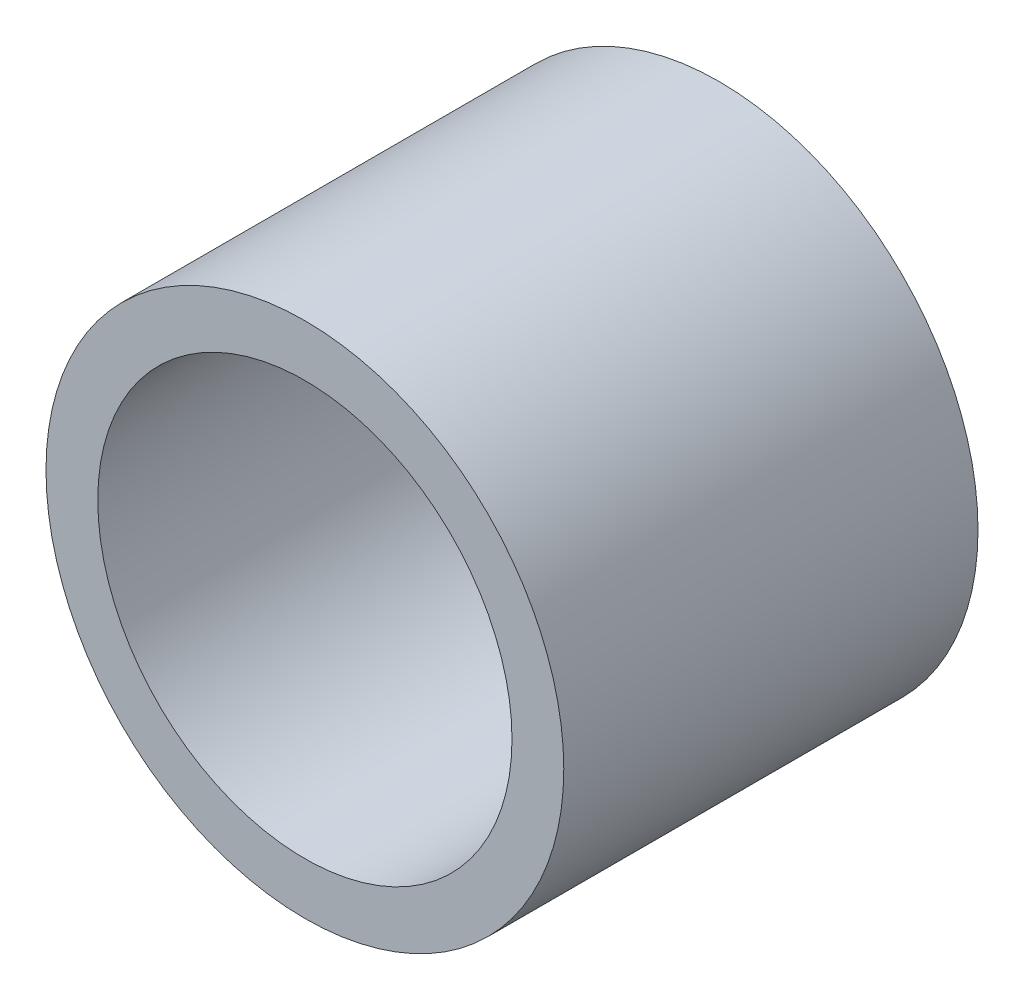
ISO-10303-21;
HEADER;
FILE_DESCRIPTION(('STEP AP214'),'2;1');
FILE_NAME('part.step','',(''),(''),'','','');
FILE_SCHEMA(('AUTOMOTIVE_DESIGN { 1 0 10303 214 1 1 1 1 }'));
ENDSEC;
DATA;
#1=APPLICATION_CONTEXT('core data for automotive mechanical design processes');
#2=APPLICATION_PROTOCOL_DEFINITION('international standard','automotive_design',2000,#1);
#3=PRODUCT_CONTEXT('',#1,'mechanical');
#4=PRODUCT('Part','Part','',(#3));
#5=PRODUCT_RELATED_PRODUCT_CATEGORY('part','',(#4));
#6=PRODUCT_DEFINITION_FORMATION('','',#4);
#7=PRODUCT_DEFINITION_CONTEXT('part definition',#1,'design');
#8=PRODUCT_DEFINITION('design','',#6,#7);
#9=PRODUCT_DEFINITION_SHAPE('','',#8);
#10=(LENGTH_UNIT() NAMED_UNIT(*) SI_UNIT(.MILLI.,.METRE.));
#11=(NAMED_UNIT(*) PLANE_ANGLE_UNIT() SI_UNIT($,.RADIAN.));
#12=(NAMED_UNIT(*) SI_UNIT($,.STERADIAN.) SOLID_ANGLE_UNIT());
#13=UNCERTAINTY_MEASURE_WITH_UNIT(LENGTH_MEASURE(1.E-05),#10,'distance_accuracy_value','');
#14=(GEOMETRIC_REPRESENTATION_CONTEXT(3) GLOBAL_UNCERTAINTY_ASSIGNED_CONTEXT((#13)) GLOBAL_UNIT_ASSIGNED_CONTEXT((#10,
#11,#12)) REPRESENTATION_CONTEXT('',''));
#15=CARTESIAN_POINT('',(0.,0.,0.));
#16=DIRECTION('',(0.,0.,1.));
#17=DIRECTION('',(1.,0.,0.));
#18=AXIS2_PLACEMENT_3D('',#15,#16,#17);
#19=CARTESIAN_POINT('',(0.,0.,2.));
#20=DIRECTION('',(0.,0.,1.));
#21=DIRECTION('',(1.,0.,0.));
#22=AXIS2_PLACEMENT_3D('',#19,#20,#21);
#23=PLANE('',#22);
#24=CARTESIAN_POINT('',(0.,0.,2.));
#25=DIRECTION('',(0.,0.,1.));
#26=DIRECTION('',(1.,0.,0.));
#27=AXIS2_PLACEMENT_3D('',#24,#25,#26);
#28=CIRCLE('',#27,1.25);
#29=CARTESIAN_POINT('',(1.25,0.,2.));
#30=VERTEX_POINT('',#29);
#31=EDGE_CURVE('E10',#30,#30,#28,.T.);
#32=ORIENTED_EDGE('',*,*,#31,.T.);
#33=EDGE_LOOP('',(#32));
#34=FACE_BOUND('',#33,.T.);
#35=CARTESIAN_POINT('',(0.,0.,2.));
#36=DIRECTION('',(0.,0.,1.));
#37=DIRECTION('',(1.,0.,0.));
#38=AXIS2_PLACEMENT_3D('',#35,#36,#37);
#39=CIRCLE('',#38,1.);
#40=CARTESIAN_POINT('',(1.,0.,2.));
#41=VERTEX_POINT('',#40);
#42=EDGE_CURVE('E41',#41,#41,#39,.T.);
#43=ORIENTED_EDGE('',*,*,#42,.F.);
#44=EDGE_LOOP('',(#43));
#45=FACE_BOUND('',#44,.T.);
#46=ADVANCED_FACE('F30',(#34,#45),#23,.T.);
#47=CARTESIAN_POINT('',(0.,0.,0.));
#48=DIRECTION('',(0.,0.,1.));
#49=DIRECTION('',(1.,0.,0.));
#50=AXIS2_PLACEMENT_3D('',#47,#48,#49);
#51=PLANE('',#50);
#52=CARTESIAN_POINT('',(0.,0.,0.));
#53=DIRECTION('',(0.,0.,1.));
#54=DIRECTION('',(1.,0.,0.));
#55=AXIS2_PLACEMENT_3D('',#52,#53,#54);
#56=CIRCLE('',#55,1.25);
#57=CARTESIAN_POINT('',(1.25,0.,0.));
#58=VERTEX_POINT('',#57);
#59=EDGE_CURVE('E34',#58,#58,#56,.T.);
#60=ORIENTED_EDGE('',*,*,#59,.F.);
#61=EDGE_LOOP('',(#60));
#62=FACE_BOUND('',#61,.T.);
#63=CARTESIAN_POINT('',(0.,0.,0.));
#64=DIRECTION('',(0.,0.,1.));
#65=DIRECTION('',(1.,0.,0.));
#66=AXIS2_PLACEMENT_3D('',#63,#64,#65);
#67=CIRCLE('',#66,1.);
#68=CARTESIAN_POINT('',(1.,0.,0.));
#69=VERTEX_POINT('',#68);
#70=EDGE_CURVE('E43',#69,#69,#67,.T.);
#71=ORIENTED_EDGE('',*,*,#70,.T.);
#72=EDGE_LOOP('',(#71));
#73=FACE_BOUND('',#72,.T.);
#74=ADVANCED_FACE('F53',(#62,#73),#51,.F.);
#75=CARTESIAN_POINT('',(0.,0.,2.));
#76=DIRECTION('',(0.,0.,-1.));
#77=DIRECTION('',(-1.,0.,0.));
#78=AXIS2_PLACEMENT_3D('',#75,#76,#77);
#79=CYLINDRICAL_SURFACE('',#78,1.25);
#80=ORIENTED_EDGE('',*,*,#31,.F.);
#81=EDGE_LOOP('',(#80));
#82=FACE_BOUND('',#81,.T.);
#83=ORIENTED_EDGE('',*,*,#59,.T.);
#84=EDGE_LOOP('',(#83));
#85=FACE_BOUND('',#84,.T.);
#86=ADVANCED_FACE('F32',(#82,#85),#79,.T.);
#87=CARTESIAN_POINT('',(0.,0.,2.));
#88=DIRECTION('',(0.,0.,-1.));
#89=DIRECTION('',(-1.,0.,0.));
#90=AXIS2_PLACEMENT_3D('',#87,#88,#89);
#91=CYLINDRICAL_SURFACE('',#90,1.);
#92=ORIENTED_EDGE('',*,*,#42,.T.);
#93=EDGE_LOOP('',(#92));
#94=FACE_BOUND('',#93,.T.);
#95=ORIENTED_EDGE('',*,*,#70,.F.);
#96=EDGE_LOOP('',(#95));
#97=FACE_BOUND('',#96,.T.);
#98=ADVANCED_FACE('F49',(#94,#97),#91,.F.);
#99=CLOSED_SHELL('',(#46,#74,#86,#98));
#100=MANIFOLD_SOLID_BREP('B2',#99);
#101=ADVANCED_BREP_SHAPE_REPRESENTATION('',(#18,#100),#14);
#102=SHAPE_DEFINITION_REPRESENTATION(#9,#101);
ENDSEC;
END-ISO-10303-21;
